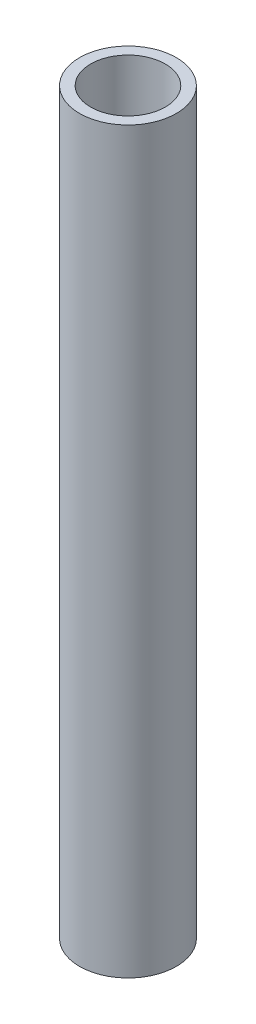
ISO-10303-21;
HEADER;
FILE_DESCRIPTION(('STEP AP214'),'2;1');
FILE_NAME('part.step','',(''),(''),'','','');
FILE_SCHEMA(('AUTOMOTIVE_DESIGN { 1 0 10303 214 1 1 1 1 }'));
ENDSEC;
DATA;
#1=APPLICATION_CONTEXT('core data for automotive mechanical design processes');
#2=APPLICATION_PROTOCOL_DEFINITION('international standard','automotive_design',2000,#1);
#3=PRODUCT_CONTEXT('',#1,'mechanical');
#4=PRODUCT('Part','Part','',(#3));
#5=PRODUCT_RELATED_PRODUCT_CATEGORY('part','',(#4));
#6=PRODUCT_DEFINITION_FORMATION('','',#4);
#7=PRODUCT_DEFINITION_CONTEXT('part definition',#1,'design');
#8=PRODUCT_DEFINITION('design','',#6,#7);
#9=PRODUCT_DEFINITION_SHAPE('','',#8);
#10=(LENGTH_UNIT() NAMED_UNIT(*) SI_UNIT(.MILLI.,.METRE.));
#11=(NAMED_UNIT(*) PLANE_ANGLE_UNIT() SI_UNIT($,.RADIAN.));
#12=(NAMED_UNIT(*) SI_UNIT($,.STERADIAN.) SOLID_ANGLE_UNIT());
#13=UNCERTAINTY_MEASURE_WITH_UNIT(LENGTH_MEASURE(1.E-05),#10,'distance_accuracy_value','');
#14=(GEOMETRIC_REPRESENTATION_CONTEXT(3) GLOBAL_UNCERTAINTY_ASSIGNED_CONTEXT((#13)) GLOBAL_UNIT_ASSIGNED_CONTEXT((#10,
#11,#12)) REPRESENTATION_CONTEXT('',''));
#15=CARTESIAN_POINT('',(0.,0.,0.));
#16=DIRECTION('',(0.,0.,1.));
#17=DIRECTION('',(1.,0.,0.));
#18=AXIS2_PLACEMENT_3D('',#15,#16,#17);
#19=CARTESIAN_POINT('',(0.,43.5,0.));
#20=DIRECTION('',(0.,-1.,0.));
#21=DIRECTION('',(0.,0.,-1.));
#22=AXIS2_PLACEMENT_3D('',#19,#20,#21);
#23=CYLINDRICAL_SURFACE('',#22,2.85);
#24=CARTESIAN_POINT('',(0.,43.5,0.));
#25=DIRECTION('',(0.,1.,0.));
#26=DIRECTION('',(0.,0.,1.));
#27=AXIS2_PLACEMENT_3D('',#24,#25,#26);
#28=CIRCLE('',#27,2.85);
#29=CARTESIAN_POINT('',(0.,43.5,2.85));
#30=VERTEX_POINT('',#29);
#31=EDGE_CURVE('E10',#30,#30,#28,.T.);
#32=ORIENTED_EDGE('',*,*,#31,.F.);
#33=EDGE_LOOP('',(#32));
#34=FACE_BOUND('',#33,.T.);
#35=CARTESIAN_POINT('',(0.,0.,0.));
#36=DIRECTION('',(0.,1.,0.));
#37=DIRECTION('',(0.,0.,1.));
#38=AXIS2_PLACEMENT_3D('',#35,#36,#37);
#39=CIRCLE('',#38,2.85);
#40=CARTESIAN_POINT('',(0.,0.,2.85));
#41=VERTEX_POINT('',#40);
#42=EDGE_CURVE('E37',#41,#41,#39,.T.);
#43=ORIENTED_EDGE('',*,*,#42,.T.);
#44=EDGE_LOOP('',(#43));
#45=FACE_BOUND('',#44,.T.);
#46=ADVANCED_FACE('F34',(#34,#45),#23,.T.);
#47=CARTESIAN_POINT('',(0.,43.5,0.));
#48=DIRECTION('',(0.,1.,0.));
#49=DIRECTION('',(0.,0.,1.));
#50=AXIS2_PLACEMENT_3D('',#47,#48,#49);
#51=PLANE('',#50);
#52=CARTESIAN_POINT('',(0.,43.5,0.));
#53=DIRECTION('',(0.,1.,0.));
#54=DIRECTION('',(0.,0.,1.));
#55=AXIS2_PLACEMENT_3D('',#52,#53,#54);
#56=CIRCLE('',#55,2.2);
#57=CARTESIAN_POINT('',(0.,43.5,2.2));
#58=VERTEX_POINT('',#57);
#59=EDGE_CURVE('E46',#58,#58,#56,.T.);
#60=ORIENTED_EDGE('',*,*,#59,.F.);
#61=EDGE_LOOP('',(#60));
#62=FACE_BOUND('',#61,.T.);
#63=ORIENTED_EDGE('',*,*,#31,.T.);
#64=EDGE_LOOP('',(#63));
#65=FACE_BOUND('',#64,.T.);
#66=ADVANCED_FACE('F61',(#62,#65),#51,.T.);
#67=CARTESIAN_POINT('',(0.,0.,0.));
#68=DIRECTION('',(0.,1.,0.));
#69=DIRECTION('',(0.,0.,1.));
#70=AXIS2_PLACEMENT_3D('',#67,#68,#69);
#71=PLANE('',#70);
#72=ORIENTED_EDGE('',*,*,#42,.F.);
#73=EDGE_LOOP('',(#72));
#74=FACE_BOUND('',#73,.T.);
#75=ADVANCED_FACE('F57',(#74),#71,.F.);
#76=CARTESIAN_POINT('',(0.,3.5,0.));
#77=DIRECTION('',(0.,1.,0.));
#78=DIRECTION('',(0.,0.,1.));
#79=AXIS2_PLACEMENT_3D('',#76,#77,#78);
#80=CYLINDRICAL_SURFACE('',#79,2.2);
#81=CARTESIAN_POINT('',(0.,3.5,0.));
#82=DIRECTION('',(0.,1.,0.));
#83=DIRECTION('',(0.,0.,1.));
#84=AXIS2_PLACEMENT_3D('',#81,#82,#83);
#85=CIRCLE('',#84,2.2);
#86=CARTESIAN_POINT('',(0.,3.5,2.2));
#87=VERTEX_POINT('',#86);
#88=EDGE_CURVE('E44',#87,#87,#85,.T.);
#89=ORIENTED_EDGE('',*,*,#88,.F.);
#90=EDGE_LOOP('',(#89));
#91=FACE_BOUND('',#90,.T.);
#92=ORIENTED_EDGE('',*,*,#59,.T.);
#93=EDGE_LOOP('',(#92));
#94=FACE_BOUND('',#93,.T.);
#95=ADVANCED_FACE('F54',(#91,#94),#80,.F.);
#96=CARTESIAN_POINT('',(0.,3.5,0.));
#97=DIRECTION('',(0.,1.,0.));
#98=DIRECTION('',(0.,0.,1.));
#99=AXIS2_PLACEMENT_3D('',#96,#97,#98);
#100=PLANE('',#99);
#101=ORIENTED_EDGE('',*,*,#88,.T.);
#102=EDGE_LOOP('',(#101));
#103=FACE_BOUND('',#102,.T.);
#104=ADVANCED_FACE('F52',(#103),#100,.T.);
#105=CLOSED_SHELL('',(#46,#66,#75,#95,#104));
#106=MANIFOLD_SOLID_BREP('B2',#105);
#107=ADVANCED_BREP_SHAPE_REPRESENTATION('',(#18,#106),#14);
#108=SHAPE_DEFINITION_REPRESENTATION(#9,#107);
ENDSEC;
END-ISO-10303-21;
